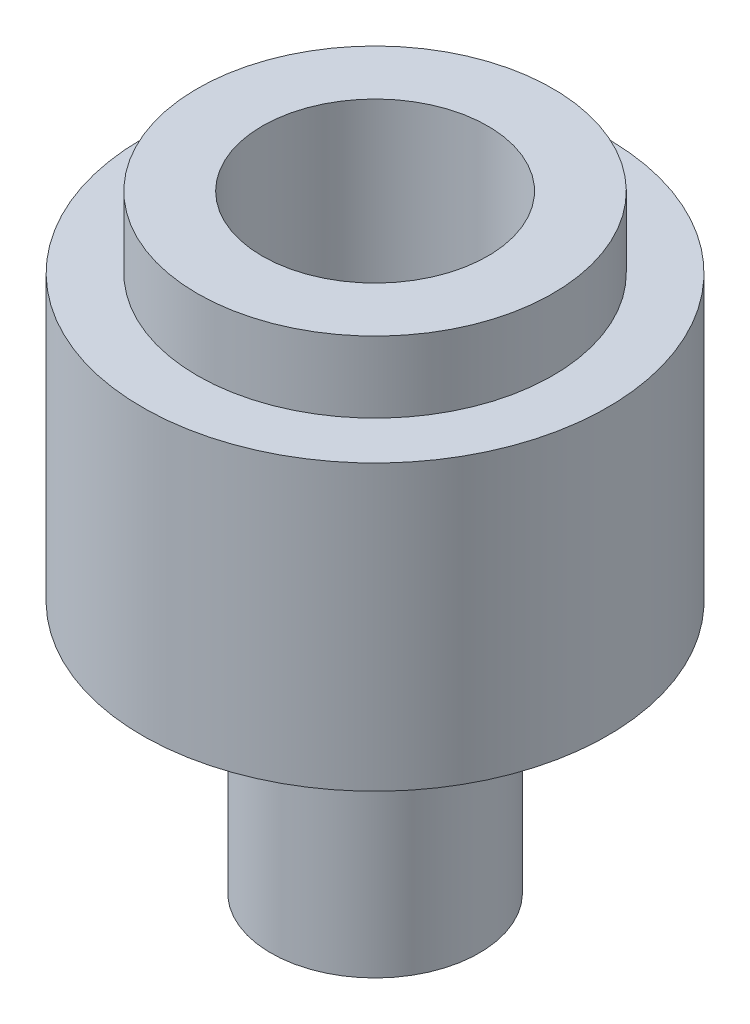
ISO-10303-21;
HEADER;
FILE_DESCRIPTION(('STEP AP214'),'2;1');
FILE_NAME('part.step','',(''),(''),'','','');
FILE_SCHEMA(('AUTOMOTIVE_DESIGN { 1 0 10303 214 1 1 1 1 }'));
ENDSEC;
DATA;
#1=APPLICATION_CONTEXT('core data for automotive mechanical design processes');
#2=APPLICATION_PROTOCOL_DEFINITION('international standard','automotive_design',2000,#1);
#3=PRODUCT_CONTEXT('',#1,'mechanical');
#4=PRODUCT('Part','Part','',(#3));
#5=PRODUCT_RELATED_PRODUCT_CATEGORY('part','',(#4));
#6=PRODUCT_DEFINITION_FORMATION('','',#4);
#7=PRODUCT_DEFINITION_CONTEXT('part definition',#1,'design');
#8=PRODUCT_DEFINITION('design','',#6,#7);
#9=PRODUCT_DEFINITION_SHAPE('','',#8);
#10=(LENGTH_UNIT() NAMED_UNIT(*) SI_UNIT(.MILLI.,.METRE.));
#11=(NAMED_UNIT(*) PLANE_ANGLE_UNIT() SI_UNIT($,.RADIAN.));
#12=(NAMED_UNIT(*) SI_UNIT($,.STERADIAN.) SOLID_ANGLE_UNIT());
#13=UNCERTAINTY_MEASURE_WITH_UNIT(LENGTH_MEASURE(1.E-05),#10,'distance_accuracy_value','');
#14=(GEOMETRIC_REPRESENTATION_CONTEXT(3) GLOBAL_UNCERTAINTY_ASSIGNED_CONTEXT((#13)) GLOBAL_UNIT_ASSIGNED_CONTEXT((#10,
#11,#12)) REPRESENTATION_CONTEXT('',''));
#15=CARTESIAN_POINT('',(0.,0.,0.));
#16=DIRECTION('',(0.,0.,1.));
#17=DIRECTION('',(1.,0.,0.));
#18=AXIS2_PLACEMENT_3D('',#15,#16,#17);
#19=CARTESIAN_POINT('',(0.,6.64674675818642,0.));
#20=DIRECTION('',(0.,1.,0.));
#21=DIRECTION('',(-1.,0.,0.));
#22=AXIS2_PLACEMENT_3D('',#19,#20,#21);
#23=CYLINDRICAL_SURFACE('',#22,2.2);
#24=CARTESIAN_POINT('',(0.,5.03538077049612,0.));
#25=DIRECTION('',(0.,1.,0.));
#26=DIRECTION('',(-1.,0.,0.));
#27=AXIS2_PLACEMENT_3D('',#24,#25,#26);
#28=CIRCLE('',#27,2.2);
#29=CARTESIAN_POINT('',(-2.2,5.03538077049612,0.));
#30=VERTEX_POINT('',#29);
#31=EDGE_CURVE('E48',#30,#30,#28,.T.);
#32=ORIENTED_EDGE('',*,*,#31,.F.);
#33=EDGE_LOOP('',(#32));
#34=FACE_BOUND('',#33,.T.);
#35=CARTESIAN_POINT('',(0.,1.27017059221717,0.));
#36=DIRECTION('',(0.,1.,0.));
#37=DIRECTION('',(-1.,0.,0.));
#38=AXIS2_PLACEMENT_3D('',#35,#36,#37);
#39=CIRCLE('',#38,2.2);
#40=CARTESIAN_POINT('',(-2.2,1.27017059221717,0.));
#41=VERTEX_POINT('',#40);
#42=EDGE_CURVE('E72',#41,#41,#39,.T.);
#43=ORIENTED_EDGE('',*,*,#42,.T.);
#44=EDGE_LOOP('',(#43));
#45=FACE_BOUND('',#44,.T.);
#46=ADVANCED_FACE('F45',(#34,#45),#23,.T.);
#47=CARTESIAN_POINT('',(0.,5.03538077049612,0.));
#48=DIRECTION('',(0.,1.,0.));
#49=DIRECTION('',(-1.,0.,0.));
#50=AXIS2_PLACEMENT_3D('',#47,#48,#49);
#51=CONICAL_SURFACE('',#50,2.2,1.0471975511966);
#52=CARTESIAN_POINT('',(0.,6.6,0.));
#53=DIRECTION('',(0.,1.,0.));
#54=DIRECTION('',(-1.,0.,0.));
#55=AXIS2_PLACEMENT_3D('',#52,#53,#54);
#56=CIRCLE('',#55,4.91);
#57=CARTESIAN_POINT('',(-4.91,6.6,0.));
#58=VERTEX_POINT('',#57);
#59=EDGE_CURVE('E79',#58,#58,#56,.T.);
#60=ORIENTED_EDGE('',*,*,#59,.F.);
#61=EDGE_LOOP('',(#60));
#62=FACE_BOUND('',#61,.T.);
#63=ORIENTED_EDGE('',*,*,#31,.T.);
#64=EDGE_LOOP('',(#63));
#65=FACE_BOUND('',#64,.T.);
#66=ADVANCED_FACE('F94',(#62,#65),#51,.T.);
#67=CARTESIAN_POINT('',(0.,6.64674675818642,0.));
#68=DIRECTION('',(0.,1.,0.));
#69=DIRECTION('',(-1.,0.,0.));
#70=AXIS2_PLACEMENT_3D('',#67,#68,#69);
#71=CYLINDRICAL_SURFACE('',#70,4.91);
#72=CARTESIAN_POINT('',(0.,12.6,0.));
#73=DIRECTION('',(0.,1.,0.));
#74=DIRECTION('',(-1.,0.,0.));
#75=AXIS2_PLACEMENT_3D('',#72,#73,#74);
#76=CIRCLE('',#75,4.91);
#77=CARTESIAN_POINT('',(-4.91,12.6,0.));
#78=VERTEX_POINT('',#77);
#79=EDGE_CURVE('E71',#78,#78,#76,.T.);
#80=ORIENTED_EDGE('',*,*,#79,.F.);
#81=EDGE_LOOP('',(#80));
#82=FACE_BOUND('',#81,.T.);
#83=ORIENTED_EDGE('',*,*,#59,.T.);
#84=EDGE_LOOP('',(#83));
#85=FACE_BOUND('',#84,.T.);
#86=ADVANCED_FACE('F110',(#82,#85),#71,.T.);
#87=CARTESIAN_POINT('',(4.91,12.6,0.));
#88=DIRECTION('',(0.,-1.,0.));
#89=DIRECTION('',(1.,0.,0.));
#90=AXIS2_PLACEMENT_3D('',#87,#88,#89);
#91=PLANE('',#90);
#92=CARTESIAN_POINT('',(0.,12.6,0.));
#93=DIRECTION('',(0.,1.,0.));
#94=DIRECTION('',(0.,0.,1.));
#95=AXIS2_PLACEMENT_3D('',#92,#93,#94);
#96=CIRCLE('',#95,3.75);
#97=CARTESIAN_POINT('',(0.,12.6,3.75));
#98=VERTEX_POINT('',#97);
#99=EDGE_CURVE('E11',#98,#98,#96,.T.);
#100=ORIENTED_EDGE('',*,*,#99,.F.);
#101=EDGE_LOOP('',(#100));
#102=FACE_BOUND('',#101,.T.);
#103=ORIENTED_EDGE('',*,*,#79,.T.);
#104=EDGE_LOOP('',(#103));
#105=FACE_BOUND('',#104,.T.);
#106=ADVANCED_FACE('F103',(#102,#105),#91,.F.);
#107=CARTESIAN_POINT('',(0.,0.,0.));
#108=DIRECTION('',(0.,1.,0.));
#109=DIRECTION('',(-1.,0.,0.));
#110=AXIS2_PLACEMENT_3D('',#107,#108,#109);
#111=CONICAL_SURFACE('',#110,0.,1.0471975511966);
#112=ORIENTED_EDGE('',*,*,#42,.F.);
#113=EDGE_LOOP('',(#112));
#114=FACE_BOUND('',#113,.T.);
#115=CARTESIAN_POINT('',(0.,0.,0.));
#116=VERTEX_POINT('',#115);
#117=VERTEX_LOOP('',#116);
#118=FACE_BOUND('',#117,.T.);
#119=ADVANCED_FACE('F100',(#114,#118),#111,.T.);
#120=CARTESIAN_POINT('',(0.,14.1,0.));
#121=DIRECTION('',(0.,1.,0.));
#122=DIRECTION('',(0.,0.,1.));
#123=AXIS2_PLACEMENT_3D('',#120,#121,#122);
#124=PLANE('',#123);
#125=CARTESIAN_POINT('',(0.,14.1,0.));
#126=DIRECTION('',(0.,1.,0.));
#127=DIRECTION('',(0.,0.,1.));
#128=AXIS2_PLACEMENT_3D('',#125,#126,#127);
#129=CIRCLE('',#128,3.75);
#130=CARTESIAN_POINT('',(0.,14.1,3.75));
#131=VERTEX_POINT('',#130);
#132=EDGE_CURVE('E83',#131,#131,#129,.T.);
#133=ORIENTED_EDGE('',*,*,#132,.T.);
#134=EDGE_LOOP('',(#133));
#135=FACE_BOUND('',#134,.T.);
#136=CARTESIAN_POINT('',(0.,14.1,0.));
#137=DIRECTION('',(0.,1.,0.));
#138=DIRECTION('',(0.,0.,1.));
#139=AXIS2_PLACEMENT_3D('',#136,#137,#138);
#140=CIRCLE('',#139,2.38);
#141=CARTESIAN_POINT('',(0.,14.1,2.38));
#142=VERTEX_POINT('',#141);
#143=EDGE_CURVE('E194',#142,#142,#140,.T.);
#144=ORIENTED_EDGE('',*,*,#143,.F.);
#145=EDGE_LOOP('',(#144));
#146=FACE_BOUND('',#145,.T.);
#147=ADVANCED_FACE('F102',(#135,#146),#124,.T.);
#148=CARTESIAN_POINT('',(0.,14.1,0.));
#149=DIRECTION('',(0.,-1.,0.));
#150=DIRECTION('',(0.,0.,-1.));
#151=AXIS2_PLACEMENT_3D('',#148,#149,#150);
#152=CYLINDRICAL_SURFACE('',#151,3.75);
#153=ORIENTED_EDGE('',*,*,#132,.F.);
#154=EDGE_LOOP('',(#153));
#155=FACE_BOUND('',#154,.T.);
#156=ORIENTED_EDGE('',*,*,#99,.T.);
#157=EDGE_LOOP('',(#156));
#158=FACE_BOUND('',#157,.T.);
#159=ADVANCED_FACE('F64',(#155,#158),#152,.T.);
#160=CARTESIAN_POINT('',(0.,8.076795031472,0.));
#161=DIRECTION('',(0.,1.,0.));
#162=DIRECTION('',(-1.,0.,0.));
#163=AXIS2_PLACEMENT_3D('',#160,#161,#162);
#164=CONICAL_SURFACE('',#163,2.38,1.02974425867666);
#165=CARTESIAN_POINT('',(0.,6.64674675818642,0.));
#166=VERTEX_POINT('',#165);
#167=VERTEX_LOOP('',#166);
#168=FACE_BOUND('',#167,.T.);
#169=CARTESIAN_POINT('',(0.,8.076795031472,0.));
#170=DIRECTION('',(0.,1.,0.));
#171=DIRECTION('',(-1.,0.,0.));
#172=AXIS2_PLACEMENT_3D('',#169,#170,#171);
#173=CIRCLE('',#172,2.38);
#174=CARTESIAN_POINT('',(-2.38,8.076795031472,0.));
#175=VERTEX_POINT('',#174);
#176=EDGE_CURVE('E68',#175,#175,#173,.T.);
#177=ORIENTED_EDGE('',*,*,#176,.T.);
#178=EDGE_LOOP('',(#177));
#179=FACE_BOUND('',#178,.T.);
#180=ADVANCED_FACE('F60',(#168,#179),#164,.F.);
#181=CARTESIAN_POINT('',(0.,6.64674675818642,0.));
#182=DIRECTION('',(0.,1.,0.));
#183=DIRECTION('',(-1.,0.,0.));
#184=AXIS2_PLACEMENT_3D('',#181,#182,#183);
#185=CYLINDRICAL_SURFACE('',#184,2.38);
#186=ORIENTED_EDGE('',*,*,#176,.F.);
#187=EDGE_LOOP('',(#186));
#188=FACE_BOUND('',#187,.T.);
#189=ORIENTED_EDGE('',*,*,#143,.T.);
#190=EDGE_LOOP('',(#189));
#191=FACE_BOUND('',#190,.T.);
#192=ADVANCED_FACE('F63',(#188,#191),#185,.F.);
#193=CLOSED_SHELL('',(#46,#66,#86,#106,#119,#147,#159,#180,#192));
#194=MANIFOLD_SOLID_BREP('B2',#193);
#195=ADVANCED_BREP_SHAPE_REPRESENTATION('',(#18,#194),#14);
#196=SHAPE_DEFINITION_REPRESENTATION(#9,#195);
ENDSEC;
END-ISO-10303-21;
